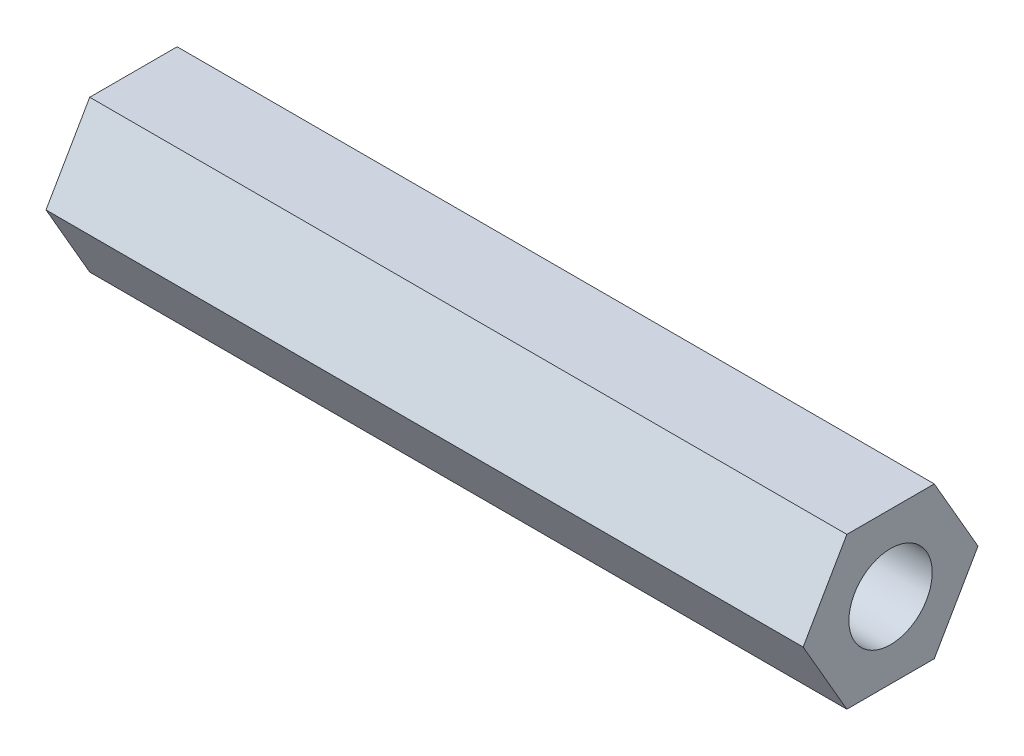
ISO-10303-21;
HEADER;
FILE_DESCRIPTION(('STEP AP214'),'2;1');
FILE_NAME('part.step','',(''),(''),'','','');
FILE_SCHEMA(('AUTOMOTIVE_DESIGN { 1 0 10303 214 1 1 1 1 }'));
ENDSEC;
DATA;
#1=APPLICATION_CONTEXT('core data for automotive mechanical design processes');
#2=APPLICATION_PROTOCOL_DEFINITION('international standard','automotive_design',2000,#1);
#3=PRODUCT_CONTEXT('',#1,'mechanical');
#4=PRODUCT('Part','Part','',(#3));
#5=PRODUCT_RELATED_PRODUCT_CATEGORY('part','',(#4));
#6=PRODUCT_DEFINITION_FORMATION('','',#4);
#7=PRODUCT_DEFINITION_CONTEXT('part definition',#1,'design');
#8=PRODUCT_DEFINITION('design','',#6,#7);
#9=PRODUCT_DEFINITION_SHAPE('','',#8);
#10=(LENGTH_UNIT() NAMED_UNIT(*) SI_UNIT(.MILLI.,.METRE.));
#11=(NAMED_UNIT(*) PLANE_ANGLE_UNIT() SI_UNIT($,.RADIAN.));
#12=(NAMED_UNIT(*) SI_UNIT($,.STERADIAN.) SOLID_ANGLE_UNIT());
#13=UNCERTAINTY_MEASURE_WITH_UNIT(LENGTH_MEASURE(1.E-05),#10,'distance_accuracy_value','');
#14=(GEOMETRIC_REPRESENTATION_CONTEXT(3) GLOBAL_UNCERTAINTY_ASSIGNED_CONTEXT((#13)) GLOBAL_UNIT_ASSIGNED_CONTEXT((#10,
#11,#12)) REPRESENTATION_CONTEXT('',''));
#15=CARTESIAN_POINT('',(0.,0.,0.));
#16=DIRECTION('',(0.,0.,1.));
#17=DIRECTION('',(1.,0.,0.));
#18=AXIS2_PLACEMENT_3D('',#15,#16,#17);
#19=CARTESIAN_POINT('',(30.,-3.,-1.73205080756888));
#20=DIRECTION('',(0.,0.5,0.866025403784439));
#21=DIRECTION('',(0.,-0.866025403784439,0.5));
#22=AXIS2_PLACEMENT_3D('',#19,#20,#21);
#23=PLANE('',#22);
#24=DIRECTION('',(0.,0.866025403784439,-0.5));
#25=VECTOR('',#24,1.);
#26=CARTESIAN_POINT('',(0.,-3.,-1.73205080756888));
#27=LINE('',#26,#25);
#28=CARTESIAN_POINT('',(0.,-3.,-1.73205080756888));
#29=VERTEX_POINT('',#28);
#30=CARTESIAN_POINT('',(0.,0.,-3.46410161513775));
#31=VERTEX_POINT('',#30);
#32=EDGE_CURVE('E127',#29,#31,#27,.T.);
#33=ORIENTED_EDGE('',*,*,#32,.T.);
#34=DIRECTION('',(-1.,0.,0.));
#35=VECTOR('',#34,1.);
#36=CARTESIAN_POINT('',(30.,0.,-3.46410161513775));
#37=LINE('',#36,#35);
#38=CARTESIAN_POINT('',(30.,0.,-3.46410161513775));
#39=VERTEX_POINT('',#38);
#40=EDGE_CURVE('E11',#39,#31,#37,.T.);
#41=ORIENTED_EDGE('',*,*,#40,.F.);
#42=DIRECTION('',(0.,0.866025403784439,-0.5));
#43=VECTOR('',#42,1.);
#44=CARTESIAN_POINT('',(30.,-3.,-1.73205080756888));
#45=LINE('',#44,#43);
#46=CARTESIAN_POINT('',(30.,-3.,-1.73205080756888));
#47=VERTEX_POINT('',#46);
#48=EDGE_CURVE('E138',#47,#39,#45,.T.);
#49=ORIENTED_EDGE('',*,*,#48,.F.);
#50=DIRECTION('',(-1.,0.,0.));
#51=VECTOR('',#50,1.);
#52=CARTESIAN_POINT('',(30.,-3.,-1.73205080756888));
#53=LINE('',#52,#51);
#54=EDGE_CURVE('E123',#47,#29,#53,.T.);
#55=ORIENTED_EDGE('',*,*,#54,.T.);
#56=EDGE_LOOP('',(#33,#41,#49,#55));
#57=FACE_BOUND('',#56,.T.);
#58=ADVANCED_FACE('F43',(#57),#23,.F.);
#59=CARTESIAN_POINT('',(30.,0.,-3.46410161513775));
#60=DIRECTION('',(0.,-0.5,0.866025403784438));
#61=DIRECTION('',(0.,-0.866025403784439,-0.5));
#62=AXIS2_PLACEMENT_3D('',#59,#60,#61);
#63=PLANE('',#62);
#64=DIRECTION('',(0.,0.866025403784438,0.5));
#65=VECTOR('',#64,1.);
#66=CARTESIAN_POINT('',(0.,0.,-3.46410161513775));
#67=LINE('',#66,#65);
#68=CARTESIAN_POINT('',(0.,3.,-1.73205080756888));
#69=VERTEX_POINT('',#68);
#70=EDGE_CURVE('E130',#31,#69,#67,.T.);
#71=ORIENTED_EDGE('',*,*,#70,.T.);
#72=DIRECTION('',(-1.,0.,0.));
#73=VECTOR('',#72,1.);
#74=CARTESIAN_POINT('',(30.,3.,-1.73205080756888));
#75=LINE('',#74,#73);
#76=CARTESIAN_POINT('',(30.,3.,-1.73205080756888));
#77=VERTEX_POINT('',#76);
#78=EDGE_CURVE('E51',#77,#69,#75,.T.);
#79=ORIENTED_EDGE('',*,*,#78,.F.);
#80=DIRECTION('',(0.,0.866025403784438,0.5));
#81=VECTOR('',#80,1.);
#82=CARTESIAN_POINT('',(30.,0.,-3.46410161513775));
#83=LINE('',#82,#81);
#84=EDGE_CURVE('E96',#39,#77,#83,.T.);
#85=ORIENTED_EDGE('',*,*,#84,.F.);
#86=ORIENTED_EDGE('',*,*,#40,.T.);
#87=EDGE_LOOP('',(#71,#79,#85,#86));
#88=FACE_BOUND('',#87,.T.);
#89=ADVANCED_FACE('F163',(#88),#63,.F.);
#90=CARTESIAN_POINT('',(30.,3.,-1.73205080756888));
#91=DIRECTION('',(0.,-1.,0.));
#92=DIRECTION('',(0.,0.,-1.));
#93=AXIS2_PLACEMENT_3D('',#90,#91,#92);
#94=PLANE('',#93);
#95=DIRECTION('',(0.,0.,1.));
#96=VECTOR('',#95,1.);
#97=CARTESIAN_POINT('',(0.,3.,-1.73205080756888));
#98=LINE('',#97,#96);
#99=CARTESIAN_POINT('',(0.,3.,1.73205080756888));
#100=VERTEX_POINT('',#99);
#101=EDGE_CURVE('E133',#69,#100,#98,.T.);
#102=ORIENTED_EDGE('',*,*,#101,.T.);
#103=DIRECTION('',(-1.,0.,0.));
#104=VECTOR('',#103,1.);
#105=CARTESIAN_POINT('',(30.,3.,1.73205080756888));
#106=LINE('',#105,#104);
#107=CARTESIAN_POINT('',(30.,3.,1.73205080756888));
#108=VERTEX_POINT('',#107);
#109=EDGE_CURVE('E118',#108,#100,#106,.T.);
#110=ORIENTED_EDGE('',*,*,#109,.F.);
#111=DIRECTION('',(0.,0.,1.));
#112=VECTOR('',#111,1.);
#113=CARTESIAN_POINT('',(30.,3.,-1.73205080756888));
#114=LINE('',#113,#112);
#115=EDGE_CURVE('E109',#77,#108,#114,.T.);
#116=ORIENTED_EDGE('',*,*,#115,.F.);
#117=ORIENTED_EDGE('',*,*,#78,.T.);
#118=EDGE_LOOP('',(#102,#110,#116,#117));
#119=FACE_BOUND('',#118,.T.);
#120=ADVANCED_FACE('F144',(#119),#94,.F.);
#121=CARTESIAN_POINT('',(30.,3.,1.73205080756888));
#122=DIRECTION('',(0.,-0.5,-0.866025403784439));
#123=DIRECTION('',(0.,0.866025403784439,-0.5));
#124=AXIS2_PLACEMENT_3D('',#121,#122,#123);
#125=PLANE('',#124);
#126=DIRECTION('',(0.,-0.866025403784439,0.5));
#127=VECTOR('',#126,1.);
#128=CARTESIAN_POINT('',(0.,3.,1.73205080756888));
#129=LINE('',#128,#127);
#130=CARTESIAN_POINT('',(0.,0.,3.46410161513775));
#131=VERTEX_POINT('',#130);
#132=EDGE_CURVE('E117',#100,#131,#129,.T.);
#133=ORIENTED_EDGE('',*,*,#132,.T.);
#134=DIRECTION('',(-1.,0.,0.));
#135=VECTOR('',#134,1.);
#136=CARTESIAN_POINT('',(30.,0.,3.46410161513775));
#137=LINE('',#136,#135);
#138=CARTESIAN_POINT('',(30.,0.,3.46410161513775));
#139=VERTEX_POINT('',#138);
#140=EDGE_CURVE('E114',#139,#131,#137,.T.);
#141=ORIENTED_EDGE('',*,*,#140,.F.);
#142=DIRECTION('',(0.,-0.866025403784439,0.5));
#143=VECTOR('',#142,1.);
#144=CARTESIAN_POINT('',(30.,3.,1.73205080756888));
#145=LINE('',#144,#143);
#146=EDGE_CURVE('E103',#108,#139,#145,.T.);
#147=ORIENTED_EDGE('',*,*,#146,.F.);
#148=ORIENTED_EDGE('',*,*,#109,.T.);
#149=EDGE_LOOP('',(#133,#141,#147,#148));
#150=FACE_BOUND('',#149,.T.);
#151=ADVANCED_FACE('F115',(#150),#125,.F.);
#152=CARTESIAN_POINT('',(30.,0.,3.46410161513775));
#153=DIRECTION('',(0.,0.5,-0.866025403784438));
#154=DIRECTION('',(0.,0.866025403784439,0.5));
#155=AXIS2_PLACEMENT_3D('',#152,#153,#154);
#156=PLANE('',#155);
#157=DIRECTION('',(0.,-0.866025403784438,-0.5));
#158=VECTOR('',#157,1.);
#159=CARTESIAN_POINT('',(0.,0.,3.46410161513775));
#160=LINE('',#159,#158);
#161=CARTESIAN_POINT('',(0.,-3.,1.73205080756888));
#162=VERTEX_POINT('',#161);
#163=EDGE_CURVE('E82',#131,#162,#160,.T.);
#164=ORIENTED_EDGE('',*,*,#163,.T.);
#165=DIRECTION('',(-1.,0.,0.));
#166=VECTOR('',#165,1.);
#167=CARTESIAN_POINT('',(30.,-3.,1.73205080756888));
#168=LINE('',#167,#166);
#169=CARTESIAN_POINT('',(30.,-3.,1.73205080756888));
#170=VERTEX_POINT('',#169);
#171=EDGE_CURVE('E119',#170,#162,#168,.T.);
#172=ORIENTED_EDGE('',*,*,#171,.F.);
#173=DIRECTION('',(0.,-0.866025403784438,-0.5));
#174=VECTOR('',#173,1.);
#175=CARTESIAN_POINT('',(30.,0.,3.46410161513775));
#176=LINE('',#175,#174);
#177=EDGE_CURVE('E107',#139,#170,#176,.T.);
#178=ORIENTED_EDGE('',*,*,#177,.F.);
#179=ORIENTED_EDGE('',*,*,#140,.T.);
#180=EDGE_LOOP('',(#164,#172,#178,#179));
#181=FACE_BOUND('',#180,.T.);
#182=ADVANCED_FACE('F121',(#181),#156,.F.);
#183=CARTESIAN_POINT('',(30.,-3.,1.73205080756888));
#184=DIRECTION('',(0.,1.,0.));
#185=DIRECTION('',(0.,0.,1.));
#186=AXIS2_PLACEMENT_3D('',#183,#184,#185);
#187=PLANE('',#186);
#188=DIRECTION('',(0.,0.,-1.));
#189=VECTOR('',#188,1.);
#190=CARTESIAN_POINT('',(0.,-3.,1.73205080756888));
#191=LINE('',#190,#189);
#192=EDGE_CURVE('E88',#162,#29,#191,.T.);
#193=ORIENTED_EDGE('',*,*,#192,.T.);
#194=ORIENTED_EDGE('',*,*,#54,.F.);
#195=DIRECTION('',(0.,0.,-1.));
#196=VECTOR('',#195,1.);
#197=CARTESIAN_POINT('',(30.,-3.,1.73205080756888));
#198=LINE('',#197,#196);
#199=EDGE_CURVE('E59',#170,#47,#198,.T.);
#200=ORIENTED_EDGE('',*,*,#199,.F.);
#201=ORIENTED_EDGE('',*,*,#171,.T.);
#202=EDGE_LOOP('',(#193,#194,#200,#201));
#203=FACE_BOUND('',#202,.T.);
#204=ADVANCED_FACE('F151',(#203),#187,.F.);
#205=CARTESIAN_POINT('',(30.,0.,0.));
#206=DIRECTION('',(1.,0.,0.));
#207=DIRECTION('',(0.,0.,-1.));
#208=AXIS2_PLACEMENT_3D('',#205,#206,#207);
#209=PLANE('',#208);
#210=CARTESIAN_POINT('',(30.,0.,0.));
#211=DIRECTION('',(-1.,0.,0.));
#212=DIRECTION('',(0.,0.,1.));
#213=AXIS2_PLACEMENT_3D('',#210,#211,#212);
#214=CIRCLE('',#213,1.64999999999999);
#215=CARTESIAN_POINT('',(30.,0.,1.64999999999999));
#216=VERTEX_POINT('',#215);
#217=EDGE_CURVE('E131',#216,#216,#214,.T.);
#218=ORIENTED_EDGE('',*,*,#217,.T.);
#219=EDGE_LOOP('',(#218));
#220=FACE_BOUND('',#219,.T.);
#221=ORIENTED_EDGE('',*,*,#48,.T.);
#222=ORIENTED_EDGE('',*,*,#84,.T.);
#223=ORIENTED_EDGE('',*,*,#115,.T.);
#224=ORIENTED_EDGE('',*,*,#146,.T.);
#225=ORIENTED_EDGE('',*,*,#177,.T.);
#226=ORIENTED_EDGE('',*,*,#199,.T.);
#227=EDGE_LOOP('',(#221,#222,#223,#224,#225,#226));
#228=FACE_BOUND('',#227,.T.);
#229=ADVANCED_FACE('F105',(#220,#228),#209,.T.);
#230=CARTESIAN_POINT('',(0.,0.,0.));
#231=DIRECTION('',(1.,0.,0.));
#232=DIRECTION('',(0.,0.,-1.));
#233=AXIS2_PLACEMENT_3D('',#230,#231,#232);
#234=PLANE('',#233);
#235=CARTESIAN_POINT('',(0.,0.,0.));
#236=DIRECTION('',(-1.,0.,0.));
#237=DIRECTION('',(0.,0.,1.));
#238=AXIS2_PLACEMENT_3D('',#235,#236,#237);
#239=CIRCLE('',#238,1.64999999999999);
#240=CARTESIAN_POINT('',(0.,0.,1.64999999999999));
#241=VERTEX_POINT('',#240);
#242=EDGE_CURVE('E239',#241,#241,#239,.T.);
#243=ORIENTED_EDGE('',*,*,#242,.F.);
#244=EDGE_LOOP('',(#243));
#245=FACE_BOUND('',#244,.T.);
#246=ORIENTED_EDGE('',*,*,#32,.F.);
#247=ORIENTED_EDGE('',*,*,#192,.F.);
#248=ORIENTED_EDGE('',*,*,#163,.F.);
#249=ORIENTED_EDGE('',*,*,#132,.F.);
#250=ORIENTED_EDGE('',*,*,#101,.F.);
#251=ORIENTED_EDGE('',*,*,#70,.F.);
#252=EDGE_LOOP('',(#246,#247,#248,#249,#250,#251));
#253=FACE_BOUND('',#252,.T.);
#254=ADVANCED_FACE('F147',(#245,#253),#234,.F.);
#255=CARTESIAN_POINT('',(0.,0.,0.));
#256=DIRECTION('',(-1.,0.,0.));
#257=DIRECTION('',(0.,0.,1.));
#258=AXIS2_PLACEMENT_3D('',#255,#256,#257);
#259=CYLINDRICAL_SURFACE('',#258,1.64999999999999);
#260=ORIENTED_EDGE('',*,*,#217,.F.);
#261=EDGE_LOOP('',(#260));
#262=FACE_BOUND('',#261,.T.);
#263=ORIENTED_EDGE('',*,*,#242,.T.);
#264=EDGE_LOOP('',(#263));
#265=FACE_BOUND('',#264,.T.);
#266=ADVANCED_FACE('F202',(#262,#265),#259,.F.);
#267=CLOSED_SHELL('',(#58,#89,#120,#151,#182,#204,#229,#254,#266));
#268=MANIFOLD_SOLID_BREP('B2',#267);
#269=ADVANCED_BREP_SHAPE_REPRESENTATION('',(#18,#268),#14);
#270=SHAPE_DEFINITION_REPRESENTATION(#9,#269);
ENDSEC;
END-ISO-10303-21;
